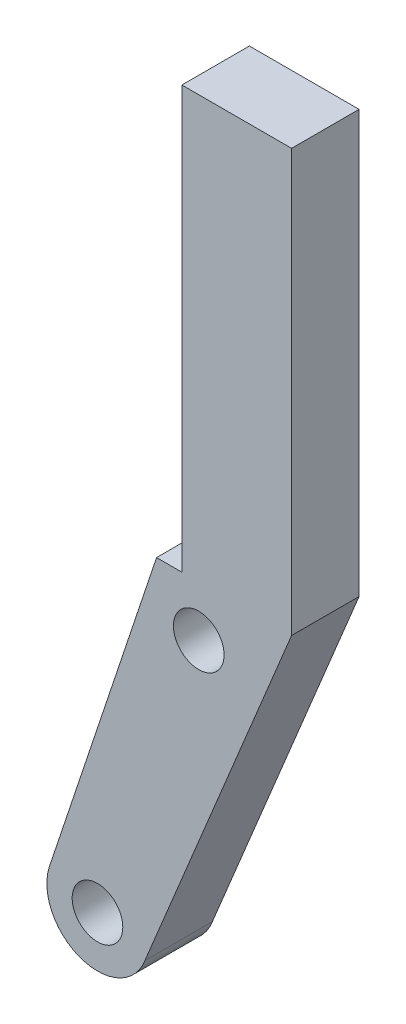
ISO-10303-21;
HEADER;
FILE_DESCRIPTION(('STEP AP214'),'2;1');
FILE_NAME('part.step','',(''),(''),'','','');
FILE_SCHEMA(('AUTOMOTIVE_DESIGN { 1 0 10303 214 1 1 1 1 }'));
ENDSEC;
DATA;
#1=APPLICATION_CONTEXT('core data for automotive mechanical design processes');
#2=APPLICATION_PROTOCOL_DEFINITION('international standard','automotive_design',2000,#1);
#3=PRODUCT_CONTEXT('',#1,'mechanical');
#4=PRODUCT('Part','Part','',(#3));
#5=PRODUCT_RELATED_PRODUCT_CATEGORY('part','',(#4));
#6=PRODUCT_DEFINITION_FORMATION('','',#4);
#7=PRODUCT_DEFINITION_CONTEXT('part definition',#1,'design');
#8=PRODUCT_DEFINITION('design','',#6,#7);
#9=PRODUCT_DEFINITION_SHAPE('','',#8);
#10=(LENGTH_UNIT() NAMED_UNIT(*) SI_UNIT(.MILLI.,.METRE.));
#11=(NAMED_UNIT(*) PLANE_ANGLE_UNIT() SI_UNIT($,.RADIAN.));
#12=(NAMED_UNIT(*) SI_UNIT($,.STERADIAN.) SOLID_ANGLE_UNIT());
#13=UNCERTAINTY_MEASURE_WITH_UNIT(LENGTH_MEASURE(1.E-05),#10,'distance_accuracy_value','');
#14=(GEOMETRIC_REPRESENTATION_CONTEXT(3) GLOBAL_UNCERTAINTY_ASSIGNED_CONTEXT((#13)) GLOBAL_UNIT_ASSIGNED_CONTEXT((#10,
#11,#12)) REPRESENTATION_CONTEXT('',''));
#15=CARTESIAN_POINT('',(0.,0.,0.));
#16=DIRECTION('',(0.,0.,1.));
#17=DIRECTION('',(1.,0.,0.));
#18=AXIS2_PLACEMENT_3D('',#15,#16,#17);
#19=CARTESIAN_POINT('',(2.98851401370246,2.99538422198705,4.));
#20=DIRECTION('',(0.,0.,1.));
#21=DIRECTION('',(1.,0.,0.));
#22=AXIS2_PLACEMENT_3D('',#19,#20,#21);
#23=PLANE('',#22);
#24=CARTESIAN_POINT('',(2.98851401370246,2.99538422198705,4.));
#25=DIRECTION('',(0.,0.,1.));
#26=DIRECTION('',(1.,0.,0.));
#27=AXIS2_PLACEMENT_3D('',#24,#25,#26);
#28=CIRCLE('',#27,1.5);
#29=CARTESIAN_POINT('',(4.48851401370246,2.99538422198705,4.));
#30=VERTEX_POINT('',#29);
#31=EDGE_CURVE('E127',#30,#30,#28,.T.);
#32=ORIENTED_EDGE('',*,*,#31,.F.);
#33=EDGE_LOOP('',(#32));
#34=FACE_BOUND('',#33,.T.);
#35=DIRECTION('',(0.382030025179881,0.924149912006196,0.));
#36=VECTOR('',#35,1.);
#37=CARTESIAN_POINT('',(5.79485970512764,1.9349956798857,4.));
#38=LINE('',#37,#36);
#39=CARTESIAN_POINT('',(5.79485970512765,1.9349956798857,4.));
#40=VERTEX_POINT('',#39);
#41=CARTESIAN_POINT('',(14.4885140137024,22.9653842219871,4.));
#42=VERTEX_POINT('',#41);
#43=EDGE_CURVE('E136',#40,#42,#38,.T.);
#44=ORIENTED_EDGE('',*,*,#43,.T.);
#45=DIRECTION('',(0.,1.,0.));
#46=VECTOR('',#45,1.);
#47=CARTESIAN_POINT('',(14.4885140137024,22.9653842219871,4.));
#48=LINE('',#47,#46);
#49=CARTESIAN_POINT('',(14.4885140137024,47.965384221987,4.));
#50=VERTEX_POINT('',#49);
#51=EDGE_CURVE('E89',#42,#50,#48,.T.);
#52=ORIENTED_EDGE('',*,*,#51,.T.);
#53=DIRECTION('',(-1.,0.,0.));
#54=VECTOR('',#53,1.);
#55=CARTESIAN_POINT('',(14.4885140137024,47.965384221987,4.));
#56=LINE('',#55,#54);
#57=CARTESIAN_POINT('',(7.9885140137024,47.965384221987,4.));
#58=VERTEX_POINT('',#57);
#59=EDGE_CURVE('E148',#50,#58,#56,.T.);
#60=ORIENTED_EDGE('',*,*,#59,.T.);
#61=DIRECTION('',(0.,-1.,0.));
#62=VECTOR('',#61,1.);
#63=CARTESIAN_POINT('',(7.9885140137024,47.965384221987,4.));
#64=LINE('',#63,#62);
#65=CARTESIAN_POINT('',(7.9885140137024,22.9653842219871,4.));
#66=VERTEX_POINT('',#65);
#67=EDGE_CURVE('E105',#58,#66,#64,.T.);
#68=ORIENTED_EDGE('',*,*,#67,.T.);
#69=DIRECTION('',(-1.,0.,0.));
#70=VECTOR('',#69,1.);
#71=CARTESIAN_POINT('',(7.9885140137024,22.9653842219871,4.));
#72=LINE('',#71,#70);
#73=CARTESIAN_POINT('',(6.48851401370246,22.9653842219871,4.));
#74=VERTEX_POINT('',#73);
#75=EDGE_CURVE('E99',#66,#74,#72,.T.);
#76=ORIENTED_EDGE('',*,*,#75,.T.);
#77=DIRECTION('',(-0.316435931287166,-0.948613884249237,0.));
#78=VECTOR('',#77,1.);
#79=CARTESIAN_POINT('',(0.12000074048018,3.87380985990316,4.));
#80=LINE('',#79,#78);
#81=CARTESIAN_POINT('',(0.12000074048018,3.87380985990316,4.));
#82=VERTEX_POINT('',#81);
#83=EDGE_CURVE('E103',#74,#82,#80,.T.);
#84=ORIENTED_EDGE('',*,*,#83,.T.);
#85=CARTESIAN_POINT('',(2.98851401370246,2.99538422198705,4.));
#86=DIRECTION('',(0.,0.,1.));
#87=DIRECTION('',(1.,0.,0.));
#88=AXIS2_PLACEMENT_3D('',#85,#86,#87);
#89=CIRCLE('',#88,3.0000000000001);
#90=EDGE_CURVE('E49',#82,#40,#89,.T.);
#91=ORIENTED_EDGE('',*,*,#90,.T.);
#92=EDGE_LOOP('',(#44,#52,#60,#68,#76,#84,#91));
#93=FACE_BOUND('',#92,.T.);
#94=CARTESIAN_POINT('',(8.98851401370263,19.965384221987,4.));
#95=DIRECTION('',(0.,0.,1.));
#96=DIRECTION('',(1.,0.,0.));
#97=AXIS2_PLACEMENT_3D('',#94,#95,#96);
#98=CIRCLE('',#97,1.5);
#99=CARTESIAN_POINT('',(10.4885140137026,19.965384221987,4.));
#100=VERTEX_POINT('',#99);
#101=EDGE_CURVE('E163',#100,#100,#98,.T.);
#102=ORIENTED_EDGE('',*,*,#101,.F.);
#103=EDGE_LOOP('',(#102));
#104=FACE_BOUND('',#103,.T.);
#105=ADVANCED_FACE('F32',(#34,#93,#104),#23,.T.);
#106=CARTESIAN_POINT('',(2.98851401370246,2.99538422198705,0.));
#107=DIRECTION('',(0.,0.,1.));
#108=DIRECTION('',(1.,0.,0.));
#109=AXIS2_PLACEMENT_3D('',#106,#107,#108);
#110=PLANE('',#109);
#111=CARTESIAN_POINT('',(2.98851401370246,2.99538422198705,0.));
#112=DIRECTION('',(0.,0.,1.));
#113=DIRECTION('',(1.,0.,0.));
#114=AXIS2_PLACEMENT_3D('',#111,#112,#113);
#115=CIRCLE('',#114,1.5);
#116=CARTESIAN_POINT('',(4.48851401370246,2.99538422198705,0.));
#117=VERTEX_POINT('',#116);
#118=EDGE_CURVE('E160',#117,#117,#115,.T.);
#119=ORIENTED_EDGE('',*,*,#118,.T.);
#120=EDGE_LOOP('',(#119));
#121=FACE_BOUND('',#120,.T.);
#122=DIRECTION('',(0.382030025179881,0.924149912006196,0.));
#123=VECTOR('',#122,1.);
#124=CARTESIAN_POINT('',(5.79485970512764,1.9349956798857,0.));
#125=LINE('',#124,#123);
#126=CARTESIAN_POINT('',(5.79485970512765,1.9349956798857,0.));
#127=VERTEX_POINT('',#126);
#128=CARTESIAN_POINT('',(14.4885140137024,22.9653842219871,0.));
#129=VERTEX_POINT('',#128);
#130=EDGE_CURVE('E123',#127,#129,#125,.T.);
#131=ORIENTED_EDGE('',*,*,#130,.F.);
#132=CARTESIAN_POINT('',(2.98851401370246,2.99538422198705,0.));
#133=DIRECTION('',(0.,0.,1.));
#134=DIRECTION('',(1.,0.,0.));
#135=AXIS2_PLACEMENT_3D('',#132,#133,#134);
#136=CIRCLE('',#135,3.0000000000001);
#137=CARTESIAN_POINT('',(0.12000074048018,3.87380985990316,0.));
#138=VERTEX_POINT('',#137);
#139=EDGE_CURVE('E81',#138,#127,#136,.T.);
#140=ORIENTED_EDGE('',*,*,#139,.F.);
#141=DIRECTION('',(-0.316435931287166,-0.948613884249237,0.));
#142=VECTOR('',#141,1.);
#143=CARTESIAN_POINT('',(0.12000074048018,3.87380985990316,0.));
#144=LINE('',#143,#142);
#145=CARTESIAN_POINT('',(6.48851401370246,22.9653842219871,0.));
#146=VERTEX_POINT('',#145);
#147=EDGE_CURVE('E75',#146,#138,#144,.T.);
#148=ORIENTED_EDGE('',*,*,#147,.F.);
#149=DIRECTION('',(-1.,0.,0.));
#150=VECTOR('',#149,1.);
#151=CARTESIAN_POINT('',(7.9885140137024,22.9653842219871,0.));
#152=LINE('',#151,#150);
#153=CARTESIAN_POINT('',(7.9885140137024,22.9653842219871,0.));
#154=VERTEX_POINT('',#153);
#155=EDGE_CURVE('E113',#154,#146,#152,.T.);
#156=ORIENTED_EDGE('',*,*,#155,.F.);
#157=DIRECTION('',(0.,-1.,0.));
#158=VECTOR('',#157,1.);
#159=CARTESIAN_POINT('',(7.9885140137024,47.965384221987,0.));
#160=LINE('',#159,#158);
#161=CARTESIAN_POINT('',(7.9885140137024,47.965384221987,0.));
#162=VERTEX_POINT('',#161);
#163=EDGE_CURVE('E131',#162,#154,#160,.T.);
#164=ORIENTED_EDGE('',*,*,#163,.F.);
#165=DIRECTION('',(-1.,0.,0.));
#166=VECTOR('',#165,1.);
#167=CARTESIAN_POINT('',(14.4885140137024,47.965384221987,0.));
#168=LINE('',#167,#166);
#169=CARTESIAN_POINT('',(14.4885140137024,47.965384221987,0.));
#170=VERTEX_POINT('',#169);
#171=EDGE_CURVE('E129',#170,#162,#168,.T.);
#172=ORIENTED_EDGE('',*,*,#171,.F.);
#173=DIRECTION('',(0.,1.,0.));
#174=VECTOR('',#173,1.);
#175=CARTESIAN_POINT('',(14.4885140137024,22.9653842219871,0.));
#176=LINE('',#175,#174);
#177=EDGE_CURVE('E126',#129,#170,#176,.T.);
#178=ORIENTED_EDGE('',*,*,#177,.F.);
#179=EDGE_LOOP('',(#131,#140,#148,#156,#164,#172,#178));
#180=FACE_BOUND('',#179,.T.);
#181=CARTESIAN_POINT('',(8.98851401370263,19.965384221987,0.));
#182=DIRECTION('',(0.,0.,1.));
#183=DIRECTION('',(1.,0.,0.));
#184=AXIS2_PLACEMENT_3D('',#181,#182,#183);
#185=CIRCLE('',#184,1.5);
#186=CARTESIAN_POINT('',(10.4885140137026,19.965384221987,0.));
#187=VERTEX_POINT('',#186);
#188=EDGE_CURVE('E166',#187,#187,#185,.T.);
#189=ORIENTED_EDGE('',*,*,#188,.T.);
#190=EDGE_LOOP('',(#189));
#191=FACE_BOUND('',#190,.T.);
#192=ADVANCED_FACE('F152',(#121,#180,#191),#110,.F.);
#193=CARTESIAN_POINT('',(5.79485970512764,1.9349956798857,4.));
#194=DIRECTION('',(-0.924149912006196,0.382030025179881,0.));
#195=DIRECTION('',(-0.382030025179881,-0.924149912006196,0.));
#196=AXIS2_PLACEMENT_3D('',#193,#194,#195);
#197=PLANE('',#196);
#198=ORIENTED_EDGE('',*,*,#130,.T.);
#199=DIRECTION('',(0.,0.,-1.));
#200=VECTOR('',#199,1.);
#201=CARTESIAN_POINT('',(14.4885140137024,22.9653842219871,4.));
#202=LINE('',#201,#200);
#203=EDGE_CURVE('E11',#42,#129,#202,.T.);
#204=ORIENTED_EDGE('',*,*,#203,.F.);
#205=ORIENTED_EDGE('',*,*,#43,.F.);
#206=DIRECTION('',(0.,0.,-1.));
#207=VECTOR('',#206,1.);
#208=CARTESIAN_POINT('',(5.79485970512765,1.9349956798857,4.));
#209=LINE('',#208,#207);
#210=EDGE_CURVE('E119',#40,#127,#209,.T.);
#211=ORIENTED_EDGE('',*,*,#210,.T.);
#212=EDGE_LOOP('',(#198,#204,#205,#211));
#213=FACE_BOUND('',#212,.T.);
#214=ADVANCED_FACE('F34',(#213),#197,.F.);
#215=CARTESIAN_POINT('',(14.4885140137024,22.9653842219871,4.));
#216=DIRECTION('',(-1.,0.,0.));
#217=DIRECTION('',(0.,0.,1.));
#218=AXIS2_PLACEMENT_3D('',#215,#216,#217);
#219=PLANE('',#218);
#220=ORIENTED_EDGE('',*,*,#177,.T.);
#221=DIRECTION('',(0.,0.,-1.));
#222=VECTOR('',#221,1.);
#223=CARTESIAN_POINT('',(14.4885140137024,47.965384221987,4.));
#224=LINE('',#223,#222);
#225=EDGE_CURVE('E41',#50,#170,#224,.T.);
#226=ORIENTED_EDGE('',*,*,#225,.F.);
#227=ORIENTED_EDGE('',*,*,#51,.F.);
#228=ORIENTED_EDGE('',*,*,#203,.T.);
#229=EDGE_LOOP('',(#220,#226,#227,#228));
#230=FACE_BOUND('',#229,.T.);
#231=ADVANCED_FACE('F197',(#230),#219,.F.);
#232=CARTESIAN_POINT('',(14.4885140137024,47.965384221987,4.));
#233=DIRECTION('',(0.,-1.,0.));
#234=DIRECTION('',(0.,0.,-1.));
#235=AXIS2_PLACEMENT_3D('',#232,#233,#234);
#236=PLANE('',#235);
#237=ORIENTED_EDGE('',*,*,#171,.T.);
#238=DIRECTION('',(0.,0.,-1.));
#239=VECTOR('',#238,1.);
#240=CARTESIAN_POINT('',(7.9885140137024,47.965384221987,4.));
#241=LINE('',#240,#239);
#242=EDGE_CURVE('E140',#58,#162,#241,.T.);
#243=ORIENTED_EDGE('',*,*,#242,.F.);
#244=ORIENTED_EDGE('',*,*,#59,.F.);
#245=ORIENTED_EDGE('',*,*,#225,.T.);
#246=EDGE_LOOP('',(#237,#243,#244,#245));
#247=FACE_BOUND('',#246,.T.);
#248=ADVANCED_FACE('F146',(#247),#236,.F.);
#249=CARTESIAN_POINT('',(7.9885140137024,47.965384221987,4.));
#250=DIRECTION('',(1.,0.,0.));
#251=DIRECTION('',(0.,0.,-1.));
#252=AXIS2_PLACEMENT_3D('',#249,#250,#251);
#253=PLANE('',#252);
#254=ORIENTED_EDGE('',*,*,#163,.T.);
#255=DIRECTION('',(0.,0.,-1.));
#256=VECTOR('',#255,1.);
#257=CARTESIAN_POINT('',(7.9885140137024,22.9653842219871,4.));
#258=LINE('',#257,#256);
#259=EDGE_CURVE('E114',#66,#154,#258,.T.);
#260=ORIENTED_EDGE('',*,*,#259,.F.);
#261=ORIENTED_EDGE('',*,*,#67,.F.);
#262=ORIENTED_EDGE('',*,*,#242,.T.);
#263=EDGE_LOOP('',(#254,#260,#261,#262));
#264=FACE_BOUND('',#263,.T.);
#265=ADVANCED_FACE('F155',(#264),#253,.F.);
#266=CARTESIAN_POINT('',(7.9885140137024,22.9653842219871,4.));
#267=DIRECTION('',(0.,-1.,0.));
#268=DIRECTION('',(0.,0.,-1.));
#269=AXIS2_PLACEMENT_3D('',#266,#267,#268);
#270=PLANE('',#269);
#271=ORIENTED_EDGE('',*,*,#155,.T.);
#272=DIRECTION('',(0.,0.,-1.));
#273=VECTOR('',#272,1.);
#274=CARTESIAN_POINT('',(6.48851401370246,22.9653842219871,4.));
#275=LINE('',#274,#273);
#276=EDGE_CURVE('E110',#74,#146,#275,.T.);
#277=ORIENTED_EDGE('',*,*,#276,.F.);
#278=ORIENTED_EDGE('',*,*,#75,.F.);
#279=ORIENTED_EDGE('',*,*,#259,.T.);
#280=EDGE_LOOP('',(#271,#277,#278,#279));
#281=FACE_BOUND('',#280,.T.);
#282=ADVANCED_FACE('F111',(#281),#270,.F.);
#283=CARTESIAN_POINT('',(0.12000074048018,3.87380985990316,4.));
#284=DIRECTION('',(0.948613884249236,-0.316435931287166,0.));
#285=DIRECTION('',(0.316435931287166,0.948613884249237,0.));
#286=AXIS2_PLACEMENT_3D('',#283,#284,#285);
#287=PLANE('',#286);
#288=ORIENTED_EDGE('',*,*,#147,.T.);
#289=DIRECTION('',(0.,0.,-1.));
#290=VECTOR('',#289,1.);
#291=CARTESIAN_POINT('',(0.12000074048018,3.87380985990316,4.));
#292=LINE('',#291,#290);
#293=EDGE_CURVE('E115',#82,#138,#292,.T.);
#294=ORIENTED_EDGE('',*,*,#293,.F.);
#295=ORIENTED_EDGE('',*,*,#83,.F.);
#296=ORIENTED_EDGE('',*,*,#276,.T.);
#297=EDGE_LOOP('',(#288,#294,#295,#296));
#298=FACE_BOUND('',#297,.T.);
#299=ADVANCED_FACE('F117',(#298),#287,.F.);
#300=CARTESIAN_POINT('',(2.98851401370246,2.99538422198705,4.));
#301=DIRECTION('',(0.,0.,-1.));
#302=DIRECTION('',(-1.,0.,0.));
#303=AXIS2_PLACEMENT_3D('',#300,#301,#302);
#304=CYLINDRICAL_SURFACE('',#303,3.0000000000001);
#305=ORIENTED_EDGE('',*,*,#139,.T.);
#306=ORIENTED_EDGE('',*,*,#210,.F.);
#307=ORIENTED_EDGE('',*,*,#90,.F.);
#308=ORIENTED_EDGE('',*,*,#293,.T.);
#309=EDGE_LOOP('',(#305,#306,#307,#308));
#310=FACE_BOUND('',#309,.T.);
#311=ADVANCED_FACE('F187',(#310),#304,.T.);
#312=CARTESIAN_POINT('',(2.98851401370246,2.99538422198705,4.));
#313=DIRECTION('',(0.,0.,-1.));
#314=DIRECTION('',(-1.,0.,0.));
#315=AXIS2_PLACEMENT_3D('',#312,#313,#314);
#316=CYLINDRICAL_SURFACE('',#315,1.5);
#317=ORIENTED_EDGE('',*,*,#31,.T.);
#318=EDGE_LOOP('',(#317));
#319=FACE_BOUND('',#318,.T.);
#320=ORIENTED_EDGE('',*,*,#118,.F.);
#321=EDGE_LOOP('',(#320));
#322=FACE_BOUND('',#321,.T.);
#323=ADVANCED_FACE('F184',(#319,#322),#316,.F.);
#324=CARTESIAN_POINT('',(8.98851401370263,19.965384221987,4.));
#325=DIRECTION('',(0.,0.,-1.));
#326=DIRECTION('',(-1.,0.,0.));
#327=AXIS2_PLACEMENT_3D('',#324,#325,#326);
#328=CYLINDRICAL_SURFACE('',#327,1.5);
#329=ORIENTED_EDGE('',*,*,#101,.T.);
#330=EDGE_LOOP('',(#329));
#331=FACE_BOUND('',#330,.T.);
#332=ORIENTED_EDGE('',*,*,#188,.F.);
#333=EDGE_LOOP('',(#332));
#334=FACE_BOUND('',#333,.T.);
#335=ADVANCED_FACE('F172',(#331,#334),#328,.F.);
#336=CLOSED_SHELL('',(#105,#192,#214,#231,#248,#265,#282,#299,#311,#323,#335));
#337=MANIFOLD_SOLID_BREP('B2',#336);
#338=ADVANCED_BREP_SHAPE_REPRESENTATION('',(#18,#337),#14);
#339=SHAPE_DEFINITION_REPRESENTATION(#9,#338);
ENDSEC;
END-ISO-10303-21;
